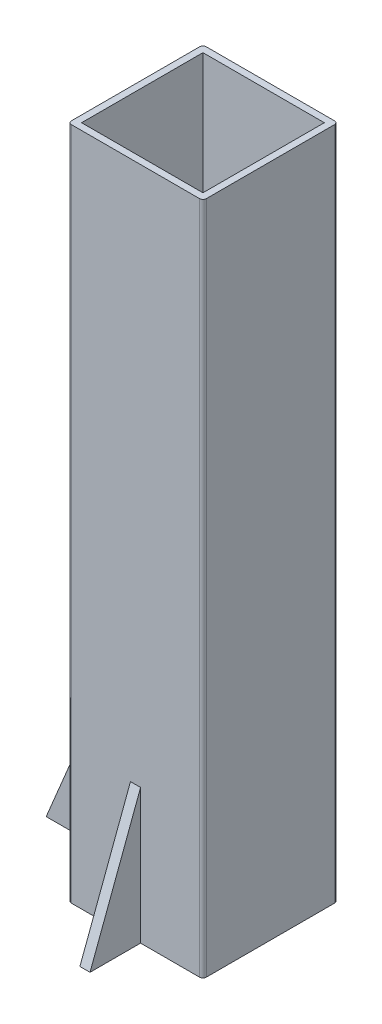
ISO-10303-21;
HEADER;
FILE_DESCRIPTION(('STEP AP214'),'2;1');
FILE_NAME('part.step','',(''),(''),'','','');
FILE_SCHEMA(('AUTOMOTIVE_DESIGN { 1 0 10303 214 1 1 1 1 }'));
ENDSEC;
DATA;
#1=APPLICATION_CONTEXT('core data for automotive mechanical design processes');
#2=APPLICATION_PROTOCOL_DEFINITION('international standard','automotive_design',2000,#1);
#3=PRODUCT_CONTEXT('',#1,'mechanical');
#4=PRODUCT('Part','Part','',(#3));
#5=PRODUCT_RELATED_PRODUCT_CATEGORY('part','',(#4));
#6=PRODUCT_DEFINITION_FORMATION('','',#4);
#7=PRODUCT_DEFINITION_CONTEXT('part definition',#1,'design');
#8=PRODUCT_DEFINITION('design','',#6,#7);
#9=PRODUCT_DEFINITION_SHAPE('','',#8);
#10=(LENGTH_UNIT() NAMED_UNIT(*) SI_UNIT(.MILLI.,.METRE.));
#11=(NAMED_UNIT(*) PLANE_ANGLE_UNIT() SI_UNIT($,.RADIAN.));
#12=(NAMED_UNIT(*) SI_UNIT($,.STERADIAN.) SOLID_ANGLE_UNIT());
#13=UNCERTAINTY_MEASURE_WITH_UNIT(LENGTH_MEASURE(1.E-05),#10,'distance_accuracy_value','');
#14=(GEOMETRIC_REPRESENTATION_CONTEXT(3) GLOBAL_UNCERTAINTY_ASSIGNED_CONTEXT((#13)) GLOBAL_UNIT_ASSIGNED_CONTEXT((#10,
#11,#12)) REPRESENTATION_CONTEXT('',''));
#15=CARTESIAN_POINT('',(0.,0.,0.));
#16=DIRECTION('',(0.,0.,1.));
#17=DIRECTION('',(1.,0.,0.));
#18=AXIS2_PLACEMENT_3D('',#15,#16,#17);
#19=CARTESIAN_POINT('',(0.,400.,-2.00000000000001));
#20=DIRECTION('',(1.,0.,0.));
#21=DIRECTION('',(0.,0.,-1.));
#22=AXIS2_PLACEMENT_3D('',#19,#20,#21);
#23=PLANE('',#22);
#24=DIRECTION('',(0.,-1.,0.));
#25=VECTOR('',#24,1.);
#26=CARTESIAN_POINT('',(0.,120.,-43.));
#27=LINE('',#26,#25);
#28=CARTESIAN_POINT('',(0.,120.,-43.));
#29=VERTEX_POINT('',#28);
#30=CARTESIAN_POINT('',(0.,0.,-43.));
#31=VERTEX_POINT('',#30);
#32=EDGE_CURVE('E187',#29,#31,#27,.T.);
#33=ORIENTED_EDGE('',*,*,#32,.F.);
#34=DIRECTION('',(0.,0.,1.));
#35=VECTOR('',#34,1.);
#36=CARTESIAN_POINT('',(0.,120.,-43.));
#37=LINE('',#36,#35);
#38=CARTESIAN_POINT('',(0.,120.,-37.));
#39=VERTEX_POINT('',#38);
#40=EDGE_CURVE('E184',#29,#39,#37,.T.);
#41=ORIENTED_EDGE('',*,*,#40,.T.);
#42=DIRECTION('',(0.,-1.,0.));
#43=VECTOR('',#42,1.);
#44=CARTESIAN_POINT('',(0.,120.,-37.));
#45=LINE('',#44,#43);
#46=CARTESIAN_POINT('',(0.,0.,-37.));
#47=VERTEX_POINT('',#46);
#48=EDGE_CURVE('E195',#39,#47,#45,.T.);
#49=ORIENTED_EDGE('',*,*,#48,.T.);
#50=DIRECTION('',(0.,0.,1.));
#51=VECTOR('',#50,1.);
#52=CARTESIAN_POINT('',(0.,0.,-2.00000000000001));
#53=LINE('',#52,#51);
#54=CARTESIAN_POINT('',(0.,0.,-2.00000000000001));
#55=VERTEX_POINT('',#54);
#56=EDGE_CURVE('E309',#47,#55,#53,.T.);
#57=ORIENTED_EDGE('',*,*,#56,.T.);
#58=DIRECTION('',(0.,-1.,0.));
#59=VECTOR('',#58,1.);
#60=CARTESIAN_POINT('',(0.,400.,-2.00000000000001));
#61=LINE('',#60,#59);
#62=CARTESIAN_POINT('',(0.,400.,-2.00000000000001));
#63=VERTEX_POINT('',#62);
#64=EDGE_CURVE('E292',#63,#55,#61,.T.);
#65=ORIENTED_EDGE('',*,*,#64,.F.);
#66=DIRECTION('',(0.,0.,1.));
#67=VECTOR('',#66,1.);
#68=CARTESIAN_POINT('',(0.,400.,-2.00000000000001));
#69=LINE('',#68,#67);
#70=CARTESIAN_POINT('',(0.,400.,-78.));
#71=VERTEX_POINT('',#70);
#72=EDGE_CURVE('E290',#71,#63,#69,.T.);
#73=ORIENTED_EDGE('',*,*,#72,.F.);
#74=DIRECTION('',(0.,-1.,0.));
#75=VECTOR('',#74,1.);
#76=CARTESIAN_POINT('',(0.,400.,-78.));
#77=LINE('',#76,#75);
#78=CARTESIAN_POINT('',(0.,0.,-78.));
#79=VERTEX_POINT('',#78);
#80=EDGE_CURVE('E313',#71,#79,#77,.T.);
#81=ORIENTED_EDGE('',*,*,#80,.T.);
#82=EDGE_CURVE('E278',#79,#31,#53,.T.);
#83=ORIENTED_EDGE('',*,*,#82,.T.);
#84=EDGE_LOOP('',(#33,#41,#49,#57,#65,#73,#81,#83));
#85=FACE_BOUND('',#84,.T.);
#86=ADVANCED_FACE('F34',(#85),#23,.F.);
#87=CARTESIAN_POINT('',(2.,400.,-2.));
#88=DIRECTION('',(0.,-1.,0.));
#89=DIRECTION('',(0.,0.,-1.));
#90=AXIS2_PLACEMENT_3D('',#87,#88,#89);
#91=PLANE('',#90);
#92=CARTESIAN_POINT('',(2.,400.,-2.));
#93=DIRECTION('',(0.,1.,0.));
#94=DIRECTION('',(0.,0.,-1.));
#95=AXIS2_PLACEMENT_3D('',#92,#93,#94);
#96=CIRCLE('',#95,2.);
#97=CARTESIAN_POINT('',(2.00000000000001,400.,0.));
#98=VERTEX_POINT('',#97);
#99=EDGE_CURVE('E274',#63,#98,#96,.T.);
#100=ORIENTED_EDGE('',*,*,#99,.T.);
#101=DIRECTION('',(1.,0.,0.));
#102=VECTOR('',#101,1.);
#103=CARTESIAN_POINT('',(2.00000000000001,400.,0.));
#104=LINE('',#103,#102);
#105=CARTESIAN_POINT('',(78.,400.,0.));
#106=VERTEX_POINT('',#105);
#107=EDGE_CURVE('E277',#98,#106,#104,.T.);
#108=ORIENTED_EDGE('',*,*,#107,.T.);
#109=CARTESIAN_POINT('',(78.,400.,-2.));
#110=DIRECTION('',(0.,1.,0.));
#111=DIRECTION('',(0.,0.,1.));
#112=AXIS2_PLACEMENT_3D('',#109,#110,#111);
#113=CIRCLE('',#112,2.);
#114=CARTESIAN_POINT('',(80.,400.,-2.00000000000001));
#115=VERTEX_POINT('',#114);
#116=EDGE_CURVE('E280',#106,#115,#113,.T.);
#117=ORIENTED_EDGE('',*,*,#116,.T.);
#118=DIRECTION('',(0.,0.,-1.));
#119=VECTOR('',#118,1.);
#120=CARTESIAN_POINT('',(80.,400.,-2.00000000000001));
#121=LINE('',#120,#119);
#122=CARTESIAN_POINT('',(80.,400.,-78.));
#123=VERTEX_POINT('',#122);
#124=EDGE_CURVE('E282',#115,#123,#121,.T.);
#125=ORIENTED_EDGE('',*,*,#124,.T.);
#126=CARTESIAN_POINT('',(78.,400.,-78.));
#127=DIRECTION('',(0.,1.,0.));
#128=DIRECTION('',(0.,0.,-1.));
#129=AXIS2_PLACEMENT_3D('',#126,#127,#128);
#130=CIRCLE('',#129,2.);
#131=CARTESIAN_POINT('',(78.,400.,-80.));
#132=VERTEX_POINT('',#131);
#133=EDGE_CURVE('E284',#123,#132,#130,.T.);
#134=ORIENTED_EDGE('',*,*,#133,.T.);
#135=DIRECTION('',(-1.,0.,0.));
#136=VECTOR('',#135,1.);
#137=CARTESIAN_POINT('',(2.00000000000001,400.,-80.));
#138=LINE('',#137,#136);
#139=CARTESIAN_POINT('',(2.00000000000001,400.,-80.));
#140=VERTEX_POINT('',#139);
#141=EDGE_CURVE('E286',#132,#140,#138,.T.);
#142=ORIENTED_EDGE('',*,*,#141,.T.);
#143=CARTESIAN_POINT('',(2.,400.,-78.));
#144=DIRECTION('',(0.,1.,0.));
#145=DIRECTION('',(0.,0.,-1.));
#146=AXIS2_PLACEMENT_3D('',#143,#144,#145);
#147=CIRCLE('',#146,2.);
#148=EDGE_CURVE('E288',#140,#71,#147,.T.);
#149=ORIENTED_EDGE('',*,*,#148,.T.);
#150=ORIENTED_EDGE('',*,*,#72,.T.);
#151=EDGE_LOOP('',(#100,#108,#117,#125,#134,#142,#149,#150));
#152=FACE_BOUND('',#151,.T.);
#153=DIRECTION('',(0.,0.,1.));
#154=VECTOR('',#153,1.);
#155=CARTESIAN_POINT('',(4.,400.,-4.));
#156=LINE('',#155,#154);
#157=CARTESIAN_POINT('',(4.,400.,-76.));
#158=VERTEX_POINT('',#157);
#159=CARTESIAN_POINT('',(4.,400.,-4.));
#160=VERTEX_POINT('',#159);
#161=EDGE_CURVE('E244',#158,#160,#156,.T.);
#162=ORIENTED_EDGE('',*,*,#161,.F.);
#163=DIRECTION('',(-1.,0.,0.));
#164=VECTOR('',#163,1.);
#165=CARTESIAN_POINT('',(4.,400.,-76.));
#166=LINE('',#165,#164);
#167=CARTESIAN_POINT('',(76.,400.,-76.));
#168=VERTEX_POINT('',#167);
#169=EDGE_CURVE('E252',#168,#158,#166,.T.);
#170=ORIENTED_EDGE('',*,*,#169,.F.);
#171=DIRECTION('',(0.,0.,-1.));
#172=VECTOR('',#171,1.);
#173=CARTESIAN_POINT('',(76.,400.,-4.));
#174=LINE('',#173,#172);
#175=CARTESIAN_POINT('',(76.,400.,-4.));
#176=VERTEX_POINT('',#175);
#177=EDGE_CURVE('E249',#176,#168,#174,.T.);
#178=ORIENTED_EDGE('',*,*,#177,.F.);
#179=DIRECTION('',(1.,0.,0.));
#180=VECTOR('',#179,1.);
#181=CARTESIAN_POINT('',(4.,400.,-4.));
#182=LINE('',#181,#180);
#183=EDGE_CURVE('E246',#160,#176,#182,.T.);
#184=ORIENTED_EDGE('',*,*,#183,.F.);
#185=EDGE_LOOP('',(#162,#170,#178,#184));
#186=FACE_BOUND('',#185,.T.);
#187=ADVANCED_FACE('F350',(#152,#186),#91,.F.);
#188=CARTESIAN_POINT('',(2.,0.,-2.));
#189=DIRECTION('',(0.,-1.,0.));
#190=DIRECTION('',(0.,0.,-1.));
#191=AXIS2_PLACEMENT_3D('',#188,#189,#190);
#192=PLANE('',#191);
#193=DIRECTION('',(1.,0.,0.));
#194=VECTOR('',#193,1.);
#195=CARTESIAN_POINT('',(4.,0.,-4.));
#196=LINE('',#195,#194);
#197=CARTESIAN_POINT('',(4.,0.,-4.));
#198=VERTEX_POINT('',#197);
#199=CARTESIAN_POINT('',(76.,0.,-4.));
#200=VERTEX_POINT('',#199);
#201=EDGE_CURVE('E257',#198,#200,#196,.T.);
#202=ORIENTED_EDGE('',*,*,#201,.T.);
#203=DIRECTION('',(0.,0.,-1.));
#204=VECTOR('',#203,1.);
#205=CARTESIAN_POINT('',(76.,0.,-4.));
#206=LINE('',#205,#204);
#207=CARTESIAN_POINT('',(76.,0.,-76.));
#208=VERTEX_POINT('',#207);
#209=EDGE_CURVE('E259',#200,#208,#206,.T.);
#210=ORIENTED_EDGE('',*,*,#209,.T.);
#211=DIRECTION('',(-1.,0.,0.));
#212=VECTOR('',#211,1.);
#213=CARTESIAN_POINT('',(4.,0.,-76.));
#214=LINE('',#213,#212);
#215=CARTESIAN_POINT('',(4.,0.,-76.));
#216=VERTEX_POINT('',#215);
#217=EDGE_CURVE('E247',#208,#216,#214,.T.);
#218=ORIENTED_EDGE('',*,*,#217,.T.);
#219=DIRECTION('',(0.,0.,1.));
#220=VECTOR('',#219,1.);
#221=CARTESIAN_POINT('',(4.,0.,-4.));
#222=LINE('',#221,#220);
#223=EDGE_CURVE('E243',#216,#198,#222,.T.);
#224=ORIENTED_EDGE('',*,*,#223,.T.);
#225=EDGE_LOOP('',(#202,#210,#218,#224));
#226=FACE_BOUND('',#225,.T.);
#227=DIRECTION('',(0.,0.,1.));
#228=VECTOR('',#227,1.);
#229=CARTESIAN_POINT('',(37.,0.,-39.3395736352185));
#230=LINE('',#229,#228);
#231=CARTESIAN_POINT('',(37.,0.,0.));
#232=VERTEX_POINT('',#231);
#233=CARTESIAN_POINT('',(37.,0.,30.));
#234=VERTEX_POINT('',#233);
#235=EDGE_CURVE('E224',#232,#234,#230,.T.);
#236=ORIENTED_EDGE('',*,*,#235,.F.);
#237=DIRECTION('',(1.,0.,0.));
#238=VECTOR('',#237,1.);
#239=CARTESIAN_POINT('',(2.00000000000001,0.,0.));
#240=LINE('',#239,#238);
#241=CARTESIAN_POINT('',(2.00000000000001,0.,0.));
#242=VERTEX_POINT('',#241);
#243=EDGE_CURVE('E296',#242,#232,#240,.T.);
#244=ORIENTED_EDGE('',*,*,#243,.F.);
#245=CARTESIAN_POINT('',(2.,0.,-2.));
#246=DIRECTION('',(0.,1.,0.));
#247=DIRECTION('',(0.,0.,-1.));
#248=AXIS2_PLACEMENT_3D('',#245,#246,#247);
#249=CIRCLE('',#248,2.);
#250=EDGE_CURVE('E273',#55,#242,#249,.T.);
#251=ORIENTED_EDGE('',*,*,#250,.F.);
#252=ORIENTED_EDGE('',*,*,#56,.F.);
#253=DIRECTION('',(-1.,0.,0.));
#254=VECTOR('',#253,1.);
#255=CARTESIAN_POINT('',(0.,0.,-37.));
#256=LINE('',#255,#254);
#257=CARTESIAN_POINT('',(-50.,0.,-37.));
#258=VERTEX_POINT('',#257);
#259=EDGE_CURVE('E49',#47,#258,#256,.T.);
#260=ORIENTED_EDGE('',*,*,#259,.T.);
#261=DIRECTION('',(0.,0.,1.));
#262=VECTOR('',#261,1.);
#263=CARTESIAN_POINT('',(-50.,0.,-43.));
#264=LINE('',#263,#262);
#265=CARTESIAN_POINT('',(-50.,0.,-43.));
#266=VERTEX_POINT('',#265);
#267=EDGE_CURVE('E182',#266,#258,#264,.T.);
#268=ORIENTED_EDGE('',*,*,#267,.F.);
#269=DIRECTION('',(-1.,0.,0.));
#270=VECTOR('',#269,1.);
#271=CARTESIAN_POINT('',(0.,0.,-43.));
#272=LINE('',#271,#270);
#273=EDGE_CURVE('E188',#31,#266,#272,.T.);
#274=ORIENTED_EDGE('',*,*,#273,.F.);
#275=ORIENTED_EDGE('',*,*,#82,.F.);
#276=CARTESIAN_POINT('',(2.,0.,-78.));
#277=DIRECTION('',(0.,1.,0.));
#278=DIRECTION('',(0.,0.,-1.));
#279=AXIS2_PLACEMENT_3D('',#276,#277,#278);
#280=CIRCLE('',#279,2.);
#281=CARTESIAN_POINT('',(2.00000000000001,0.,-80.));
#282=VERTEX_POINT('',#281);
#283=EDGE_CURVE('E307',#282,#79,#280,.T.);
#284=ORIENTED_EDGE('',*,*,#283,.F.);
#285=DIRECTION('',(-1.,0.,0.));
#286=VECTOR('',#285,1.);
#287=CARTESIAN_POINT('',(2.00000000000001,0.,-80.));
#288=LINE('',#287,#286);
#289=CARTESIAN_POINT('',(37.,0.,-80.));
#290=VERTEX_POINT('',#289);
#291=EDGE_CURVE('E304',#290,#282,#288,.T.);
#292=ORIENTED_EDGE('',*,*,#291,.F.);
#293=DIRECTION('',(0.,0.,1.));
#294=VECTOR('',#293,1.);
#295=CARTESIAN_POINT('',(37.,0.,-26.225745869888));
#296=LINE('',#295,#294);
#297=CARTESIAN_POINT('',(37.,0.,-110.));
#298=VERTEX_POINT('',#297);
#299=EDGE_CURVE('E211',#290,#298,#296,.F.);
#300=ORIENTED_EDGE('',*,*,#299,.T.);
#301=DIRECTION('',(-1.,0.,0.));
#302=VECTOR('',#301,1.);
#303=CARTESIAN_POINT('',(40.,0.,-110.));
#304=LINE('',#303,#302);
#305=CARTESIAN_POINT('',(43.,0.,-110.));
#306=VERTEX_POINT('',#305);
#307=EDGE_CURVE('E210',#306,#298,#304,.T.);
#308=ORIENTED_EDGE('',*,*,#307,.F.);
#309=DIRECTION('',(0.,0.,1.));
#310=VECTOR('',#309,1.);
#311=CARTESIAN_POINT('',(43.,0.,-26.225745869888));
#312=LINE('',#311,#310);
#313=CARTESIAN_POINT('',(43.,0.,-80.));
#314=VERTEX_POINT('',#313);
#315=EDGE_CURVE('E200',#314,#306,#312,.F.);
#316=ORIENTED_EDGE('',*,*,#315,.F.);
#317=CARTESIAN_POINT('',(78.,0.,-80.));
#318=VERTEX_POINT('',#317);
#319=EDGE_CURVE('E305',#318,#314,#288,.T.);
#320=ORIENTED_EDGE('',*,*,#319,.F.);
#321=CARTESIAN_POINT('',(78.,0.,-78.));
#322=DIRECTION('',(0.,1.,0.));
#323=DIRECTION('',(0.,0.,-1.));
#324=AXIS2_PLACEMENT_3D('',#321,#322,#323);
#325=CIRCLE('',#324,2.);
#326=CARTESIAN_POINT('',(80.,0.,-78.));
#327=VERTEX_POINT('',#326);
#328=EDGE_CURVE('E302',#327,#318,#325,.T.);
#329=ORIENTED_EDGE('',*,*,#328,.F.);
#330=DIRECTION('',(0.,0.,-1.));
#331=VECTOR('',#330,1.);
#332=CARTESIAN_POINT('',(80.,0.,-2.00000000000001));
#333=LINE('',#332,#331);
#334=CARTESIAN_POINT('',(80.,0.,-2.00000000000001));
#335=VERTEX_POINT('',#334);
#336=EDGE_CURVE('E300',#335,#327,#333,.T.);
#337=ORIENTED_EDGE('',*,*,#336,.F.);
#338=CARTESIAN_POINT('',(78.,0.,-2.));
#339=DIRECTION('',(0.,1.,0.));
#340=DIRECTION('',(0.,0.,1.));
#341=AXIS2_PLACEMENT_3D('',#338,#339,#340);
#342=CIRCLE('',#341,2.);
#343=CARTESIAN_POINT('',(78.,0.,0.));
#344=VERTEX_POINT('',#343);
#345=EDGE_CURVE('E298',#344,#335,#342,.T.);
#346=ORIENTED_EDGE('',*,*,#345,.F.);
#347=CARTESIAN_POINT('',(43.,0.,0.));
#348=VERTEX_POINT('',#347);
#349=EDGE_CURVE('E295',#348,#344,#240,.T.);
#350=ORIENTED_EDGE('',*,*,#349,.F.);
#351=DIRECTION('',(0.,0.,1.));
#352=VECTOR('',#351,1.);
#353=CARTESIAN_POINT('',(43.,0.,-39.3395736352185));
#354=LINE('',#353,#352);
#355=CARTESIAN_POINT('',(43.,0.,30.));
#356=VERTEX_POINT('',#355);
#357=EDGE_CURVE('E223',#348,#356,#354,.T.);
#358=ORIENTED_EDGE('',*,*,#357,.T.);
#359=DIRECTION('',(-1.,0.,0.));
#360=VECTOR('',#359,1.);
#361=CARTESIAN_POINT('',(40.,0.,30.));
#362=LINE('',#361,#360);
#363=EDGE_CURVE('E230',#356,#234,#362,.T.);
#364=ORIENTED_EDGE('',*,*,#363,.T.);
#365=EDGE_LOOP('',(#236,#244,#251,#252,#260,#268,#274,#275,#284,#292,#300,#308,#316,#320,#329,
#337,#346,#350,#358,#364));
#366=FACE_BOUND('',#365,.T.);
#367=ADVANCED_FACE('F198',(#226,#366),#192,.T.);
#368=CARTESIAN_POINT('',(2.,400.,-2.));
#369=DIRECTION('',(0.,-1.,0.));
#370=DIRECTION('',(0.,0.,-1.));
#371=AXIS2_PLACEMENT_3D('',#368,#369,#370);
#372=CYLINDRICAL_SURFACE('',#371,2.);
#373=ORIENTED_EDGE('',*,*,#250,.T.);
#374=DIRECTION('',(0.,-1.,0.));
#375=VECTOR('',#374,1.);
#376=CARTESIAN_POINT('',(2.00000000000001,400.,0.));
#377=LINE('',#376,#375);
#378=EDGE_CURVE('E11',#98,#242,#377,.T.);
#379=ORIENTED_EDGE('',*,*,#378,.F.);
#380=ORIENTED_EDGE('',*,*,#99,.F.);
#381=ORIENTED_EDGE('',*,*,#64,.T.);
#382=EDGE_LOOP('',(#373,#379,#380,#381));
#383=FACE_BOUND('',#382,.T.);
#384=ADVANCED_FACE('F36',(#383),#372,.T.);
#385=CARTESIAN_POINT('',(2.00000000000001,400.,0.));
#386=DIRECTION('',(0.,0.,-1.));
#387=DIRECTION('',(-1.,0.,0.));
#388=AXIS2_PLACEMENT_3D('',#385,#386,#387);
#389=PLANE('',#388);
#390=DIRECTION('',(0.,1.,0.));
#391=VECTOR('',#390,1.);
#392=CARTESIAN_POINT('',(37.,400.,0.));
#393=LINE('',#392,#391);
#394=CARTESIAN_POINT('',(37.,80.,0.));
#395=VERTEX_POINT('',#394);
#396=EDGE_CURVE('E239',#232,#395,#393,.T.);
#397=ORIENTED_EDGE('',*,*,#396,.T.);
#398=DIRECTION('',(1.,0.,0.));
#399=VECTOR('',#398,1.);
#400=CARTESIAN_POINT('',(2.00000000000001,80.,0.));
#401=LINE('',#400,#399);
#402=CARTESIAN_POINT('',(43.,79.9999999999999,0.));
#403=VERTEX_POINT('',#402);
#404=EDGE_CURVE('E241',#395,#403,#401,.T.);
#405=ORIENTED_EDGE('',*,*,#404,.T.);
#406=DIRECTION('',(0.,1.,0.));
#407=VECTOR('',#406,1.);
#408=CARTESIAN_POINT('',(43.,400.,0.));
#409=LINE('',#408,#407);
#410=EDGE_CURVE('E236',#348,#403,#409,.T.);
#411=ORIENTED_EDGE('',*,*,#410,.F.);
#412=ORIENTED_EDGE('',*,*,#349,.T.);
#413=DIRECTION('',(0.,-1.,0.));
#414=VECTOR('',#413,1.);
#415=CARTESIAN_POINT('',(78.,400.,0.));
#416=LINE('',#415,#414);
#417=EDGE_CURVE('E42',#106,#344,#416,.T.);
#418=ORIENTED_EDGE('',*,*,#417,.F.);
#419=ORIENTED_EDGE('',*,*,#107,.F.);
#420=ORIENTED_EDGE('',*,*,#378,.T.);
#421=ORIENTED_EDGE('',*,*,#243,.T.);
#422=EDGE_LOOP('',(#397,#405,#411,#412,#418,#419,#420,#421));
#423=FACE_BOUND('',#422,.T.);
#424=ADVANCED_FACE('F355',(#423),#389,.F.);
#425=CARTESIAN_POINT('',(78.,400.,-2.));
#426=DIRECTION('',(0.,-1.,0.));
#427=DIRECTION('',(0.,0.,-1.));
#428=AXIS2_PLACEMENT_3D('',#425,#426,#427);
#429=CYLINDRICAL_SURFACE('',#428,2.);
#430=ORIENTED_EDGE('',*,*,#345,.T.);
#431=DIRECTION('',(0.,-1.,0.));
#432=VECTOR('',#431,1.);
#433=CARTESIAN_POINT('',(80.,400.,-2.00000000000001));
#434=LINE('',#433,#432);
#435=EDGE_CURVE('E325',#115,#335,#434,.T.);
#436=ORIENTED_EDGE('',*,*,#435,.F.);
#437=ORIENTED_EDGE('',*,*,#116,.F.);
#438=ORIENTED_EDGE('',*,*,#417,.T.);
#439=EDGE_LOOP('',(#430,#436,#437,#438));
#440=FACE_BOUND('',#439,.T.);
#441=ADVANCED_FACE('F332',(#440),#429,.T.);
#442=CARTESIAN_POINT('',(80.,400.,-2.00000000000001));
#443=DIRECTION('',(-1.,0.,0.));
#444=DIRECTION('',(0.,0.,1.));
#445=AXIS2_PLACEMENT_3D('',#442,#443,#444);
#446=PLANE('',#445);
#447=ORIENTED_EDGE('',*,*,#336,.T.);
#448=DIRECTION('',(0.,-1.,0.));
#449=VECTOR('',#448,1.);
#450=CARTESIAN_POINT('',(80.,400.,-78.));
#451=LINE('',#450,#449);
#452=EDGE_CURVE('E322',#123,#327,#451,.T.);
#453=ORIENTED_EDGE('',*,*,#452,.F.);
#454=ORIENTED_EDGE('',*,*,#124,.F.);
#455=ORIENTED_EDGE('',*,*,#435,.T.);
#456=EDGE_LOOP('',(#447,#453,#454,#455));
#457=FACE_BOUND('',#456,.T.);
#458=ADVANCED_FACE('F342',(#457),#446,.F.);
#459=CARTESIAN_POINT('',(78.,400.,-78.));
#460=DIRECTION('',(0.,-1.,0.));
#461=DIRECTION('',(0.,0.,-1.));
#462=AXIS2_PLACEMENT_3D('',#459,#460,#461);
#463=CYLINDRICAL_SURFACE('',#462,2.);
#464=ORIENTED_EDGE('',*,*,#328,.T.);
#465=DIRECTION('',(0.,-1.,0.));
#466=VECTOR('',#465,1.);
#467=CARTESIAN_POINT('',(78.,400.,-80.));
#468=LINE('',#467,#466);
#469=EDGE_CURVE('E319',#132,#318,#468,.T.);
#470=ORIENTED_EDGE('',*,*,#469,.F.);
#471=ORIENTED_EDGE('',*,*,#133,.F.);
#472=ORIENTED_EDGE('',*,*,#452,.T.);
#473=EDGE_LOOP('',(#464,#470,#471,#472));
#474=FACE_BOUND('',#473,.T.);
#475=ADVANCED_FACE('F346',(#474),#463,.T.);
#476=CARTESIAN_POINT('',(2.00000000000001,400.,-80.));
#477=DIRECTION('',(0.,0.,1.));
#478=DIRECTION('',(1.,0.,0.));
#479=AXIS2_PLACEMENT_3D('',#476,#477,#478);
#480=PLANE('',#479);
#481=DIRECTION('',(1.,0.,0.));
#482=VECTOR('',#481,1.);
#483=CARTESIAN_POINT('',(2.00000000000001,80.,-80.));
#484=LINE('',#483,#482);
#485=CARTESIAN_POINT('',(43.,79.9999999999999,-80.));
#486=VERTEX_POINT('',#485);
#487=CARTESIAN_POINT('',(37.,80.,-80.));
#488=VERTEX_POINT('',#487);
#489=EDGE_CURVE('E57',#486,#488,#484,.F.);
#490=ORIENTED_EDGE('',*,*,#489,.T.);
#491=DIRECTION('',(0.,-1.,0.));
#492=VECTOR('',#491,1.);
#493=CARTESIAN_POINT('',(37.,400.,-80.));
#494=LINE('',#493,#492);
#495=EDGE_CURVE('E220',#488,#290,#494,.T.);
#496=ORIENTED_EDGE('',*,*,#495,.T.);
#497=ORIENTED_EDGE('',*,*,#291,.T.);
#498=DIRECTION('',(0.,-1.,0.));
#499=VECTOR('',#498,1.);
#500=CARTESIAN_POINT('',(2.00000000000001,400.,-80.));
#501=LINE('',#500,#499);
#502=EDGE_CURVE('E316',#140,#282,#501,.T.);
#503=ORIENTED_EDGE('',*,*,#502,.F.);
#504=ORIENTED_EDGE('',*,*,#141,.F.);
#505=ORIENTED_EDGE('',*,*,#469,.T.);
#506=ORIENTED_EDGE('',*,*,#319,.T.);
#507=DIRECTION('',(0.,-1.,0.));
#508=VECTOR('',#507,1.);
#509=CARTESIAN_POINT('',(43.,400.,-80.));
#510=LINE('',#509,#508);
#511=EDGE_CURVE('E217',#486,#314,#510,.T.);
#512=ORIENTED_EDGE('',*,*,#511,.F.);
#513=EDGE_LOOP('',(#490,#496,#497,#503,#504,#505,#506,#512));
#514=FACE_BOUND('',#513,.T.);
#515=ADVANCED_FACE('F395',(#514),#480,.F.);
#516=CARTESIAN_POINT('',(2.,400.,-78.));
#517=DIRECTION('',(0.,-1.,0.));
#518=DIRECTION('',(0.,0.,-1.));
#519=AXIS2_PLACEMENT_3D('',#516,#517,#518);
#520=CYLINDRICAL_SURFACE('',#519,2.);
#521=ORIENTED_EDGE('',*,*,#283,.T.);
#522=ORIENTED_EDGE('',*,*,#80,.F.);
#523=ORIENTED_EDGE('',*,*,#148,.F.);
#524=ORIENTED_EDGE('',*,*,#502,.T.);
#525=EDGE_LOOP('',(#521,#522,#523,#524));
#526=FACE_BOUND('',#525,.T.);
#527=ADVANCED_FACE('F391',(#526),#520,.T.);
#528=CARTESIAN_POINT('',(4.,400.,-4.));
#529=DIRECTION('',(1.,0.,0.));
#530=DIRECTION('',(0.,0.,-1.));
#531=AXIS2_PLACEMENT_3D('',#528,#529,#530);
#532=PLANE('',#531);
#533=ORIENTED_EDGE('',*,*,#223,.F.);
#534=DIRECTION('',(0.,-1.,0.));
#535=VECTOR('',#534,1.);
#536=CARTESIAN_POINT('',(4.,400.,-76.));
#537=LINE('',#536,#535);
#538=EDGE_CURVE('E254',#158,#216,#537,.T.);
#539=ORIENTED_EDGE('',*,*,#538,.F.);
#540=ORIENTED_EDGE('',*,*,#161,.T.);
#541=DIRECTION('',(0.,-1.,0.));
#542=VECTOR('',#541,1.);
#543=CARTESIAN_POINT('',(4.,400.,-4.));
#544=LINE('',#543,#542);
#545=EDGE_CURVE('E270',#160,#198,#544,.T.);
#546=ORIENTED_EDGE('',*,*,#545,.T.);
#547=EDGE_LOOP('',(#533,#539,#540,#546));
#548=FACE_BOUND('',#547,.T.);
#549=ADVANCED_FACE('F394',(#548),#532,.T.);
#550=CARTESIAN_POINT('',(4.,400.,-4.));
#551=DIRECTION('',(0.,0.,-1.));
#552=DIRECTION('',(-1.,0.,0.));
#553=AXIS2_PLACEMENT_3D('',#550,#551,#552);
#554=PLANE('',#553);
#555=DIRECTION('',(0.,-1.,0.));
#556=VECTOR('',#555,1.);
#557=CARTESIAN_POINT('',(76.,400.,-4.));
#558=LINE('',#557,#556);
#559=EDGE_CURVE('E267',#176,#200,#558,.T.);
#560=ORIENTED_EDGE('',*,*,#559,.T.);
#561=ORIENTED_EDGE('',*,*,#201,.F.);
#562=ORIENTED_EDGE('',*,*,#545,.F.);
#563=ORIENTED_EDGE('',*,*,#183,.T.);
#564=EDGE_LOOP('',(#560,#561,#562,#563));
#565=FACE_BOUND('',#564,.T.);
#566=ADVANCED_FACE('F419',(#565),#554,.T.);
#567=CARTESIAN_POINT('',(76.,400.,-4.));
#568=DIRECTION('',(-1.,0.,0.));
#569=DIRECTION('',(0.,0.,1.));
#570=AXIS2_PLACEMENT_3D('',#567,#568,#569);
#571=PLANE('',#570);
#572=ORIENTED_EDGE('',*,*,#209,.F.);
#573=ORIENTED_EDGE('',*,*,#559,.F.);
#574=ORIENTED_EDGE('',*,*,#177,.T.);
#575=DIRECTION('',(0.,-1.,0.));
#576=VECTOR('',#575,1.);
#577=CARTESIAN_POINT('',(76.,400.,-76.));
#578=LINE('',#577,#576);
#579=EDGE_CURVE('E265',#168,#208,#578,.T.);
#580=ORIENTED_EDGE('',*,*,#579,.T.);
#581=EDGE_LOOP('',(#572,#573,#574,#580));
#582=FACE_BOUND('',#581,.T.);
#583=ADVANCED_FACE('F423',(#582),#571,.T.);
#584=CARTESIAN_POINT('',(4.,400.,-76.));
#585=DIRECTION('',(0.,0.,1.));
#586=DIRECTION('',(1.,0.,0.));
#587=AXIS2_PLACEMENT_3D('',#584,#585,#586);
#588=PLANE('',#587);
#589=ORIENTED_EDGE('',*,*,#538,.T.);
#590=ORIENTED_EDGE('',*,*,#217,.F.);
#591=ORIENTED_EDGE('',*,*,#579,.F.);
#592=ORIENTED_EDGE('',*,*,#169,.T.);
#593=EDGE_LOOP('',(#589,#590,#591,#592));
#594=FACE_BOUND('',#593,.T.);
#595=ADVANCED_FACE('F427',(#594),#588,.T.);
#596=CARTESIAN_POINT('',(40.,0.,30.));
#597=DIRECTION('',(0.,0.351123441588392,0.936329177569045));
#598=DIRECTION('',(0.,0.936329177569045,-0.351123441588392));
#599=AXIS2_PLACEMENT_3D('',#596,#597,#598);
#600=PLANE('',#599);
#601=ORIENTED_EDGE('',*,*,#404,.F.);
#602=DIRECTION('',(0.,0.936329177569045,-0.351123441588392));
#603=VECTOR('',#602,1.);
#604=CARTESIAN_POINT('',(37.,0.,30.));
#605=LINE('',#604,#603);
#606=EDGE_CURVE('E226',#234,#395,#605,.T.);
#607=ORIENTED_EDGE('',*,*,#606,.F.);
#608=ORIENTED_EDGE('',*,*,#363,.F.);
#609=DIRECTION('',(0.,0.936329177569045,-0.351123441588392));
#610=VECTOR('',#609,1.);
#611=CARTESIAN_POINT('',(43.,0.,30.));
#612=LINE('',#611,#610);
#613=EDGE_CURVE('E227',#356,#403,#612,.T.);
#614=ORIENTED_EDGE('',*,*,#613,.T.);
#615=EDGE_LOOP('',(#601,#607,#608,#614));
#616=FACE_BOUND('',#615,.T.);
#617=ADVANCED_FACE('F366',(#616),#600,.T.);
#618=CARTESIAN_POINT('',(37.,198.07875966609,-39.3395736352185));
#619=DIRECTION('',(-1.,0.,0.));
#620=DIRECTION('',(0.,0.,1.));
#621=AXIS2_PLACEMENT_3D('',#618,#619,#620);
#622=PLANE('',#621);
#623=ORIENTED_EDGE('',*,*,#396,.F.);
#624=ORIENTED_EDGE('',*,*,#235,.T.);
#625=ORIENTED_EDGE('',*,*,#606,.T.);
#626=EDGE_LOOP('',(#623,#624,#625));
#627=FACE_BOUND('',#626,.T.);
#628=ADVANCED_FACE('F363',(#627),#622,.T.);
#629=CARTESIAN_POINT('',(43.,198.07875966609,-39.3395736352185));
#630=DIRECTION('',(-1.,0.,0.));
#631=DIRECTION('',(0.,0.,1.));
#632=AXIS2_PLACEMENT_3D('',#629,#630,#631);
#633=PLANE('',#632);
#634=ORIENTED_EDGE('',*,*,#357,.F.);
#635=ORIENTED_EDGE('',*,*,#410,.T.);
#636=ORIENTED_EDGE('',*,*,#613,.F.);
#637=EDGE_LOOP('',(#634,#635,#636));
#638=FACE_BOUND('',#637,.T.);
#639=ADVANCED_FACE('F369',(#638),#633,.F.);
#640=CARTESIAN_POINT('',(40.,0.,-110.));
#641=DIRECTION('',(0.,-0.351123441588392,0.936329177569045));
#642=DIRECTION('',(0.,0.936329177569045,0.351123441588392));
#643=AXIS2_PLACEMENT_3D('',#640,#641,#642);
#644=PLANE('',#643);
#645=ORIENTED_EDGE('',*,*,#489,.F.);
#646=DIRECTION('',(0.,0.936329177569045,0.351123441588392));
#647=VECTOR('',#646,1.);
#648=CARTESIAN_POINT('',(43.,0.,-110.));
#649=LINE('',#648,#647);
#650=EDGE_CURVE('E202',#306,#486,#649,.T.);
#651=ORIENTED_EDGE('',*,*,#650,.F.);
#652=ORIENTED_EDGE('',*,*,#307,.T.);
#653=DIRECTION('',(0.,0.936329177569045,0.351123441588392));
#654=VECTOR('',#653,1.);
#655=CARTESIAN_POINT('',(37.,0.,-110.));
#656=LINE('',#655,#654);
#657=EDGE_CURVE('E207',#298,#488,#656,.T.);
#658=ORIENTED_EDGE('',*,*,#657,.T.);
#659=EDGE_LOOP('',(#645,#651,#652,#658));
#660=FACE_BOUND('',#659,.T.);
#661=ADVANCED_FACE('F371',(#660),#644,.F.);
#662=CARTESIAN_POINT('',(37.,197.198295154542,-26.225745869888));
#663=DIRECTION('',(-1.,0.,0.));
#664=DIRECTION('',(0.,0.,1.));
#665=AXIS2_PLACEMENT_3D('',#662,#663,#664);
#666=PLANE('',#665);
#667=ORIENTED_EDGE('',*,*,#495,.F.);
#668=ORIENTED_EDGE('',*,*,#657,.F.);
#669=ORIENTED_EDGE('',*,*,#299,.F.);
#670=EDGE_LOOP('',(#667,#668,#669));
#671=FACE_BOUND('',#670,.T.);
#672=ADVANCED_FACE('F377',(#671),#666,.T.);
#673=CARTESIAN_POINT('',(43.,197.198295154542,-26.225745869888));
#674=DIRECTION('',(-1.,0.,0.));
#675=DIRECTION('',(0.,0.,1.));
#676=AXIS2_PLACEMENT_3D('',#673,#674,#675);
#677=PLANE('',#676);
#678=ORIENTED_EDGE('',*,*,#650,.T.);
#679=ORIENTED_EDGE('',*,*,#511,.T.);
#680=ORIENTED_EDGE('',*,*,#315,.T.);
#681=EDGE_LOOP('',(#678,#679,#680));
#682=FACE_BOUND('',#681,.T.);
#683=ADVANCED_FACE('F498',(#682),#677,.F.);
#684=CARTESIAN_POINT('',(-50.,0.,-43.));
#685=DIRECTION('',(0.923076923076923,-0.384615384615385,0.));
#686=DIRECTION('',(0.384615384615385,0.923076923076923,0.));
#687=AXIS2_PLACEMENT_3D('',#684,#685,#686);
#688=PLANE('',#687);
#689=DIRECTION('',(0.384615384615385,0.923076923076923,0.));
#690=VECTOR('',#689,1.);
#691=CARTESIAN_POINT('',(-50.,0.,-37.));
#692=LINE('',#691,#690);
#693=EDGE_CURVE('E601',#258,#39,#692,.T.);
#694=ORIENTED_EDGE('',*,*,#693,.T.);
#695=ORIENTED_EDGE('',*,*,#40,.F.);
#696=DIRECTION('',(0.384615384615385,0.923076923076923,0.));
#697=VECTOR('',#696,1.);
#698=CARTESIAN_POINT('',(-50.,0.,-43.));
#699=LINE('',#698,#697);
#700=EDGE_CURVE('E178',#266,#29,#699,.T.);
#701=ORIENTED_EDGE('',*,*,#700,.F.);
#702=ORIENTED_EDGE('',*,*,#267,.T.);
#703=EDGE_LOOP('',(#694,#695,#701,#702));
#704=FACE_BOUND('',#703,.T.);
#705=ADVANCED_FACE('F180',(#704),#688,.F.);
#706=CARTESIAN_POINT('',(0.,0.,-43.));
#707=DIRECTION('',(0.,0.,1.));
#708=DIRECTION('',(1.,0.,0.));
#709=AXIS2_PLACEMENT_3D('',#706,#707,#708);
#710=PLANE('',#709);
#711=ORIENTED_EDGE('',*,*,#273,.T.);
#712=ORIENTED_EDGE('',*,*,#700,.T.);
#713=ORIENTED_EDGE('',*,*,#32,.T.);
#714=EDGE_LOOP('',(#711,#712,#713));
#715=FACE_BOUND('',#714,.T.);
#716=ADVANCED_FACE('F191',(#715),#710,.F.);
#717=CARTESIAN_POINT('',(0.,0.,-37.));
#718=DIRECTION('',(0.,0.,1.));
#719=DIRECTION('',(1.,0.,0.));
#720=AXIS2_PLACEMENT_3D('',#717,#718,#719);
#721=PLANE('',#720);
#722=ORIENTED_EDGE('',*,*,#259,.F.);
#723=ORIENTED_EDGE('',*,*,#48,.F.);
#724=ORIENTED_EDGE('',*,*,#693,.F.);
#725=EDGE_LOOP('',(#722,#723,#724));
#726=FACE_BOUND('',#725,.T.);
#727=ADVANCED_FACE('F533',(#726),#721,.T.);
#728=CLOSED_SHELL('',(#86,#187,#367,#384,#424,#441,#458,#475,#515,#527,#549,#566,#583,#595,#617,
#628,#639,#661,#672,#683,#705,#716,#727));
#729=MANIFOLD_SOLID_BREP('B2',#728);
#730=ADVANCED_BREP_SHAPE_REPRESENTATION('',(#18,#729),#14);
#731=SHAPE_DEFINITION_REPRESENTATION(#9,#730);
ENDSEC;
END-ISO-10303-21;
